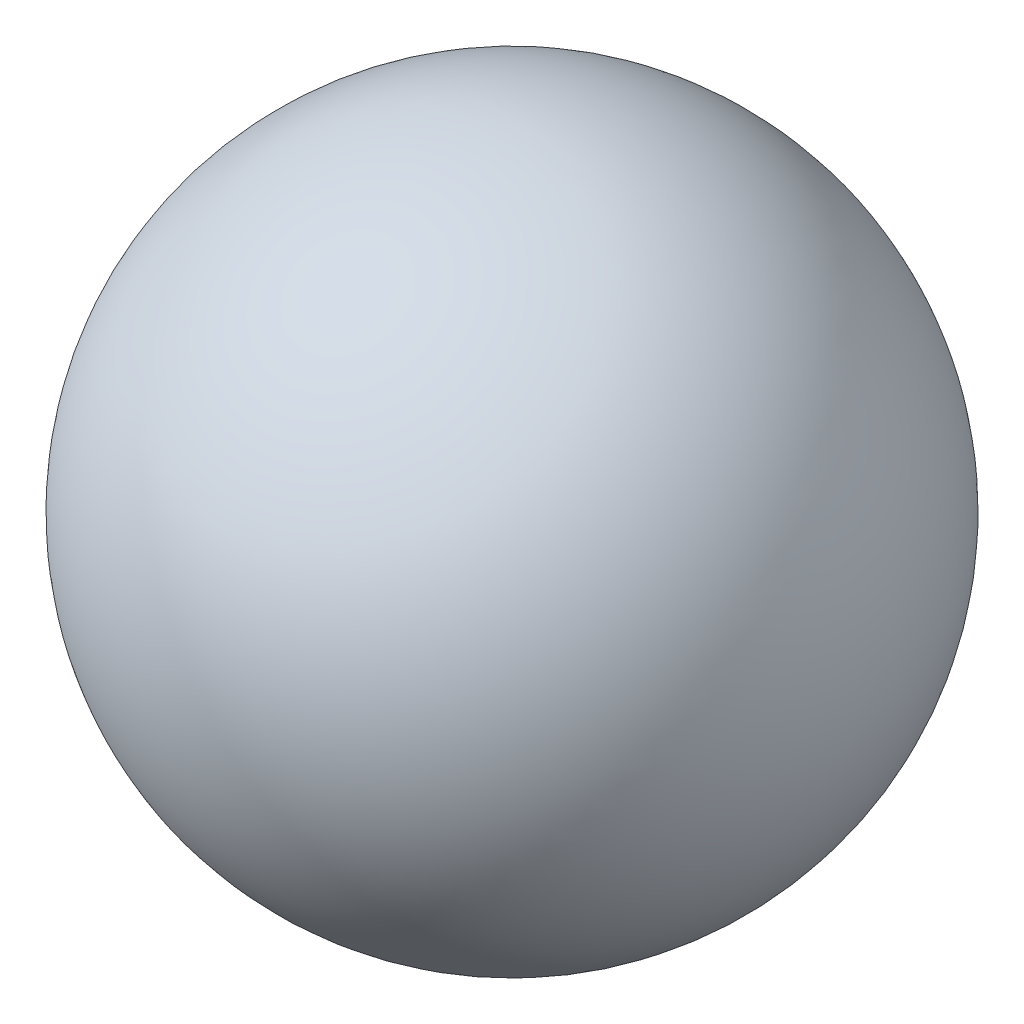
ISO-10303-21;
HEADER;
FILE_DESCRIPTION(('STEP AP214'),'2;1');
FILE_NAME('part.step','',(''),(''),'','','');
FILE_SCHEMA(('AUTOMOTIVE_DESIGN { 1 0 10303 214 1 1 1 1 }'));
ENDSEC;
DATA;
#1=APPLICATION_CONTEXT('core data for automotive mechanical design processes');
#2=APPLICATION_PROTOCOL_DEFINITION('international standard','automotive_design',2000,#1);
#3=PRODUCT_CONTEXT('',#1,'mechanical');
#4=PRODUCT('Part','Part','',(#3));
#5=PRODUCT_RELATED_PRODUCT_CATEGORY('part','',(#4));
#6=PRODUCT_DEFINITION_FORMATION('','',#4);
#7=PRODUCT_DEFINITION_CONTEXT('part definition',#1,'design');
#8=PRODUCT_DEFINITION('design','',#6,#7);
#9=PRODUCT_DEFINITION_SHAPE('','',#8);
#10=(LENGTH_UNIT() NAMED_UNIT(*) SI_UNIT(.MILLI.,.METRE.));
#11=(NAMED_UNIT(*) PLANE_ANGLE_UNIT() SI_UNIT($,.RADIAN.));
#12=(NAMED_UNIT(*) SI_UNIT($,.STERADIAN.) SOLID_ANGLE_UNIT());
#13=UNCERTAINTY_MEASURE_WITH_UNIT(LENGTH_MEASURE(1.E-05),#10,'distance_accuracy_value','');
#14=(GEOMETRIC_REPRESENTATION_CONTEXT(3) GLOBAL_UNCERTAINTY_ASSIGNED_CONTEXT((#13)) GLOBAL_UNIT_ASSIGNED_CONTEXT((#10,
#11,#12)) REPRESENTATION_CONTEXT('',''));
#15=CARTESIAN_POINT('',(0.,0.,0.));
#16=DIRECTION('',(0.,0.,1.));
#17=DIRECTION('',(1.,0.,0.));
#18=AXIS2_PLACEMENT_3D('',#15,#16,#17);
#19=CARTESIAN_POINT('',(5.38416163029708,-2.,-10.4438165216953));
#20=DIRECTION('',(0.,0.,1.));
#21=DIRECTION('',(1.,0.,0.));
#22=AXIS2_PLACEMENT_3D('',#19,#20,#21);
#23=SPHERICAL_SURFACE('',#22,1.05);
#24=CARTESIAN_POINT('',(5.38416163029708,-2.,-9.3938165216953));
#25=VERTEX_POINT('',#24);
#26=VERTEX_LOOP('',#25);
#27=FACE_BOUND('',#26,.T.);
#28=ADVANCED_FACE('F12',(#27),#23,.T.);
#29=CLOSED_SHELL('',(#28));
#30=MANIFOLD_SOLID_BREP('B1',#29);
#31=ADVANCED_BREP_SHAPE_REPRESENTATION('',(#18,#30),#14);
#32=SHAPE_DEFINITION_REPRESENTATION(#9,#31);
ENDSEC;
END-ISO-10303-21;
